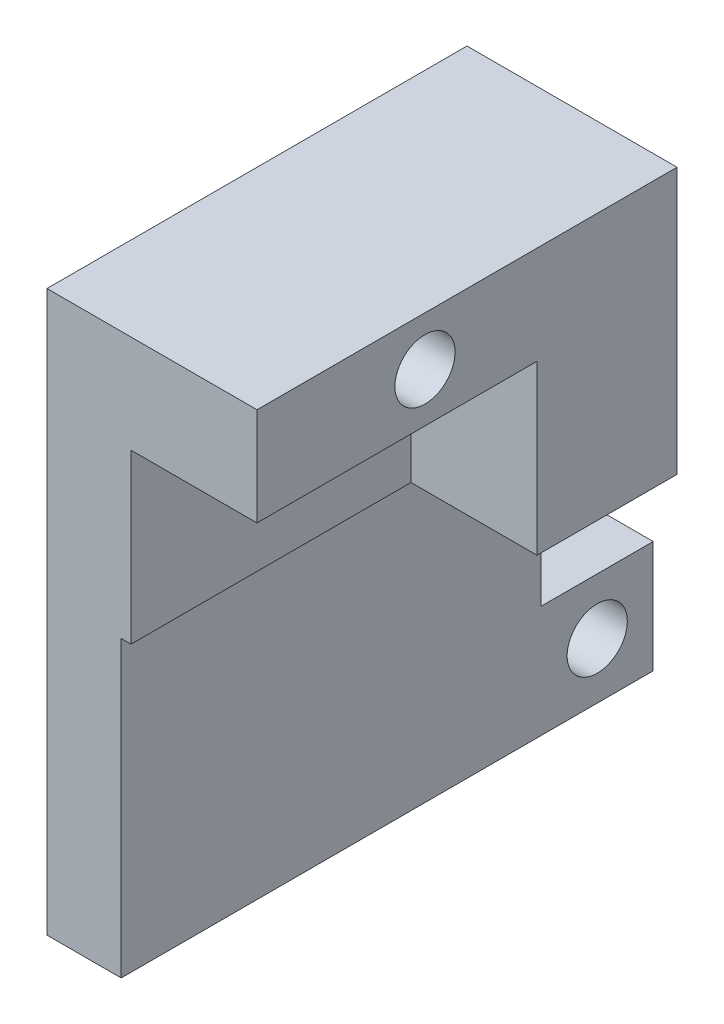
ISO-10303-21;
HEADER;
FILE_DESCRIPTION(('STEP AP214'),'2;1');
FILE_NAME('part.step','',(''),(''),'','','');
FILE_SCHEMA(('AUTOMOTIVE_DESIGN { 1 0 10303 214 1 1 1 1 }'));
ENDSEC;
DATA;
#1=APPLICATION_CONTEXT('core data for automotive mechanical design processes');
#2=APPLICATION_PROTOCOL_DEFINITION('international standard','automotive_design',2000,#1);
#3=PRODUCT_CONTEXT('',#1,'mechanical');
#4=PRODUCT('Part','Part','',(#3));
#5=PRODUCT_RELATED_PRODUCT_CATEGORY('part','',(#4));
#6=PRODUCT_DEFINITION_FORMATION('','',#4);
#7=PRODUCT_DEFINITION_CONTEXT('part definition',#1,'design');
#8=PRODUCT_DEFINITION('design','',#6,#7);
#9=PRODUCT_DEFINITION_SHAPE('','',#8);
#10=(LENGTH_UNIT() NAMED_UNIT(*) SI_UNIT(.MILLI.,.METRE.));
#11=(NAMED_UNIT(*) PLANE_ANGLE_UNIT() SI_UNIT($,.RADIAN.));
#12=(NAMED_UNIT(*) SI_UNIT($,.STERADIAN.) SOLID_ANGLE_UNIT());
#13=UNCERTAINTY_MEASURE_WITH_UNIT(LENGTH_MEASURE(1.E-05),#10,'distance_accuracy_value','');
#14=(GEOMETRIC_REPRESENTATION_CONTEXT(3) GLOBAL_UNCERTAINTY_ASSIGNED_CONTEXT((#13)) GLOBAL_UNIT_ASSIGNED_CONTEXT((#10,
#11,#12)) REPRESENTATION_CONTEXT('',''));
#15=CARTESIAN_POINT('',(0.,0.,0.));
#16=DIRECTION('',(0.,0.,1.));
#17=DIRECTION('',(1.,0.,0.));
#18=AXIS2_PLACEMENT_3D('',#15,#16,#17);
#19=CARTESIAN_POINT('',(0.,-20.,0.));
#20=DIRECTION('',(0.,1.,0.));
#21=DIRECTION('',(0.,0.,1.));
#22=AXIS2_PLACEMENT_3D('',#19,#20,#21);
#23=PLANE('',#22);
#24=DIRECTION('',(-1.,0.,0.));
#25=VECTOR('',#24,1.);
#26=CARTESIAN_POINT('',(-6.58064516129031,-20.,-39.4516129032258));
#27=LINE('',#26,#25);
#28=CARTESIAN_POINT('',(-7.28064516129031,-20.,-39.4516129032258));
#29=VERTEX_POINT('',#28);
#30=CARTESIAN_POINT('',(-12.5806451612903,-20.,-39.4516129032258));
#31=VERTEX_POINT('',#30);
#32=EDGE_CURVE('E143',#29,#31,#27,.T.);
#33=ORIENTED_EDGE('',*,*,#32,.F.);
#34=DIRECTION('',(0.,0.,-1.));
#35=VECTOR('',#34,1.);
#36=CARTESIAN_POINT('',(-7.28064516129031,-20.,-31.4516129032258));
#37=LINE('',#36,#35);
#38=CARTESIAN_POINT('',(-7.28064516129031,-20.,-1.45161290322578));
#39=VERTEX_POINT('',#38);
#40=EDGE_CURVE('E126',#39,#29,#37,.T.);
#41=ORIENTED_EDGE('',*,*,#40,.F.);
#42=DIRECTION('',(-1.,0.,0.));
#43=VECTOR('',#42,1.);
#44=CARTESIAN_POINT('',(2.42035483870969,-20.,-1.45161290322578));
#45=LINE('',#44,#43);
#46=CARTESIAN_POINT('',(-12.5806451612903,-20.,-1.45161290322578));
#47=VERTEX_POINT('',#46);
#48=EDGE_CURVE('E236',#39,#47,#45,.T.);
#49=ORIENTED_EDGE('',*,*,#48,.T.);
#50=DIRECTION('',(0.,0.,1.));
#51=VECTOR('',#50,1.);
#52=CARTESIAN_POINT('',(-12.5806451612903,-20.,-31.4516129032258));
#53=LINE('',#52,#51);
#54=EDGE_CURVE('E151',#31,#47,#53,.T.);
#55=ORIENTED_EDGE('',*,*,#54,.F.);
#56=EDGE_LOOP('',(#33,#41,#49,#55));
#57=FACE_BOUND('',#56,.T.);
#58=ADVANCED_FACE('F43',(#57),#23,.F.);
#59=CARTESIAN_POINT('',(-6.58064516129031,-12.,-39.4516129032258));
#60=DIRECTION('',(0.,-1.,0.));
#61=DIRECTION('',(0.,0.,-1.));
#62=AXIS2_PLACEMENT_3D('',#59,#60,#61);
#63=PLANE('',#62);
#64=DIRECTION('',(0.,0.,1.));
#65=VECTOR('',#64,1.);
#66=CARTESIAN_POINT('',(-7.28064516129031,-12.,-31.4516129032258));
#67=LINE('',#66,#65);
#68=CARTESIAN_POINT('',(-7.28064516129031,-12.,-39.4516129032258));
#69=VERTEX_POINT('',#68);
#70=CARTESIAN_POINT('',(-7.28064516129031,-12.,-31.4516129032258));
#71=VERTEX_POINT('',#70);
#72=EDGE_CURVE('E148',#69,#71,#67,.T.);
#73=ORIENTED_EDGE('',*,*,#72,.F.);
#74=DIRECTION('',(1.,0.,0.));
#75=VECTOR('',#74,1.);
#76=CARTESIAN_POINT('',(-6.58064516129031,-12.,-39.4516129032258));
#77=LINE('',#76,#75);
#78=CARTESIAN_POINT('',(-12.5806451612903,-12.,-39.4516129032258));
#79=VERTEX_POINT('',#78);
#80=EDGE_CURVE('E146',#79,#69,#77,.T.);
#81=ORIENTED_EDGE('',*,*,#80,.F.);
#82=DIRECTION('',(0.,0.,1.));
#83=VECTOR('',#82,1.);
#84=CARTESIAN_POINT('',(-12.5806451612903,-12.,-39.4516129032258));
#85=LINE('',#84,#83);
#86=CARTESIAN_POINT('',(-12.5806451612903,-12.,-31.4516129032258));
#87=VERTEX_POINT('',#86);
#88=EDGE_CURVE('E167',#79,#87,#85,.T.);
#89=ORIENTED_EDGE('',*,*,#88,.T.);
#90=DIRECTION('',(1.,0.,0.));
#91=VECTOR('',#90,1.);
#92=CARTESIAN_POINT('',(-6.58064516129031,-12.,-31.4516129032258));
#93=LINE('',#92,#91);
#94=EDGE_CURVE('E155',#87,#71,#93,.T.);
#95=ORIENTED_EDGE('',*,*,#94,.T.);
#96=EDGE_LOOP('',(#73,#81,#89,#95));
#97=FACE_BOUND('',#96,.T.);
#98=ADVANCED_FACE('F208',(#97),#63,.F.);
#99=CARTESIAN_POINT('',(0.,0.,-39.4516129032258));
#100=DIRECTION('',(0.,0.,-1.));
#101=DIRECTION('',(-1.,0.,0.));
#102=AXIS2_PLACEMENT_3D('',#99,#100,#101);
#103=PLANE('',#102);
#104=ORIENTED_EDGE('',*,*,#80,.T.);
#105=DIRECTION('',(0.,1.,0.));
#106=VECTOR('',#105,1.);
#107=CARTESIAN_POINT('',(-7.28064516129031,-12.,-39.4516129032258));
#108=LINE('',#107,#106);
#109=EDGE_CURVE('E130',#29,#69,#108,.T.);
#110=ORIENTED_EDGE('',*,*,#109,.F.);
#111=ORIENTED_EDGE('',*,*,#32,.T.);
#112=DIRECTION('',(0.,1.,0.));
#113=VECTOR('',#112,1.);
#114=CARTESIAN_POINT('',(-12.5806451612903,-12.,-39.4516129032258));
#115=LINE('',#114,#113);
#116=EDGE_CURVE('E154',#31,#79,#115,.T.);
#117=ORIENTED_EDGE('',*,*,#116,.T.);
#118=EDGE_LOOP('',(#104,#110,#111,#117));
#119=FACE_BOUND('',#118,.T.);
#120=ADVANCED_FACE('F142',(#119),#103,.T.);
#121=CARTESIAN_POINT('',(2.41935483870969,-16.,-35.4516129032258));
#122=DIRECTION('',(-1.,0.,0.));
#123=DIRECTION('',(0.,0.,1.));
#124=AXIS2_PLACEMENT_3D('',#121,#122,#123);
#125=CYLINDRICAL_SURFACE('',#124,2.15);
#126=CARTESIAN_POINT('',(-12.5806451612903,-16.,-35.4516129032258));
#127=DIRECTION('',(-1.,0.,0.));
#128=DIRECTION('',(0.,0.,1.));
#129=AXIS2_PLACEMENT_3D('',#126,#127,#128);
#130=CIRCLE('',#129,2.15);
#131=CARTESIAN_POINT('',(-12.5806451612903,-16.,-33.3016129032258));
#132=VERTEX_POINT('',#131);
#133=EDGE_CURVE('E161',#132,#132,#130,.T.);
#134=ORIENTED_EDGE('',*,*,#133,.T.);
#135=EDGE_LOOP('',(#134));
#136=FACE_BOUND('',#135,.T.);
#137=CARTESIAN_POINT('',(-7.28064516129031,-16.,-35.4516129032258));
#138=DIRECTION('',(1.,0.,0.));
#139=DIRECTION('',(0.,0.,-1.));
#140=AXIS2_PLACEMENT_3D('',#137,#138,#139);
#141=CIRCLE('',#140,2.15);
#142=CARTESIAN_POINT('',(-7.28064516129031,-16.,-37.6016129032258));
#143=VERTEX_POINT('',#142);
#144=EDGE_CURVE('E211',#143,#143,#141,.F.);
#145=ORIENTED_EDGE('',*,*,#144,.F.);
#146=EDGE_LOOP('',(#145));
#147=FACE_BOUND('',#146,.T.);
#148=ADVANCED_FACE('F275',(#136,#147),#125,.F.);
#149=CARTESIAN_POINT('',(-6.58064516129031,20.,-31.4516129032258));
#150=DIRECTION('',(-1.,0.,0.));
#151=DIRECTION('',(0.,0.,1.));
#152=AXIS2_PLACEMENT_3D('',#149,#150,#151);
#153=PLANE('',#152);
#154=DIRECTION('',(0.,1.,0.));
#155=VECTOR('',#154,1.);
#156=CARTESIAN_POINT('',(-6.58064516129031,20.,-1.45161290322579));
#157=LINE('',#156,#155);
#158=CARTESIAN_POINT('',(-6.58064516129031,0.999999999999997,-1.45161290322578));
#159=VERTEX_POINT('',#158);
#160=CARTESIAN_POINT('',(-6.58064516129031,13.,-1.45161290322579));
#161=VERTEX_POINT('',#160);
#162=EDGE_CURVE('E243',#159,#161,#157,.T.);
#163=ORIENTED_EDGE('',*,*,#162,.F.);
#164=DIRECTION('',(0.,0.,1.));
#165=VECTOR('',#164,1.);
#166=CARTESIAN_POINT('',(-6.58064516129031,1.,-31.4516129032258));
#167=LINE('',#166,#165);
#168=CARTESIAN_POINT('',(-6.58064516129031,1.,-21.4516129032258));
#169=VERTEX_POINT('',#168);
#170=EDGE_CURVE('E215',#169,#159,#167,.T.);
#171=ORIENTED_EDGE('',*,*,#170,.F.);
#172=DIRECTION('',(0.,1.,0.));
#173=VECTOR('',#172,1.);
#174=CARTESIAN_POINT('',(-6.58064516129031,1.,-21.4516129032258));
#175=LINE('',#174,#173);
#176=CARTESIAN_POINT('',(-6.58064516129031,13.,-21.4516129032258));
#177=VERTEX_POINT('',#176);
#178=EDGE_CURVE('E259',#169,#177,#175,.T.);
#179=ORIENTED_EDGE('',*,*,#178,.T.);
#180=DIRECTION('',(0.,0.,-1.));
#181=VECTOR('',#180,1.);
#182=CARTESIAN_POINT('',(-6.58064516129031,13.,3.54838709677421));
#183=LINE('',#182,#181);
#184=EDGE_CURVE('E177',#161,#177,#183,.T.);
#185=ORIENTED_EDGE('',*,*,#184,.F.);
#186=EDGE_LOOP('',(#163,#171,#179,#185));
#187=FACE_BOUND('',#186,.T.);
#188=ADVANCED_FACE('F311',(#187),#153,.F.);
#189=CARTESIAN_POINT('',(2.41935483870969,13.,3.5483870967742));
#190=DIRECTION('',(0.,1.,0.));
#191=DIRECTION('',(0.,0.,1.));
#192=AXIS2_PLACEMENT_3D('',#189,#190,#191);
#193=PLANE('',#192);
#194=DIRECTION('',(0.,0.,-1.));
#195=VECTOR('',#194,1.);
#196=CARTESIAN_POINT('',(2.41935483870969,13.,3.5483870967742));
#197=LINE('',#196,#195);
#198=CARTESIAN_POINT('',(2.41935483870969,13.,-1.45161290322579));
#199=VERTEX_POINT('',#198);
#200=CARTESIAN_POINT('',(2.41935483870969,13.,-21.4516129032258));
#201=VERTEX_POINT('',#200);
#202=EDGE_CURVE('E181',#199,#201,#197,.T.);
#203=ORIENTED_EDGE('',*,*,#202,.F.);
#204=DIRECTION('',(1.,0.,0.));
#205=VECTOR('',#204,1.);
#206=CARTESIAN_POINT('',(2.42035483870969,13.,-1.45161290322579));
#207=LINE('',#206,#205);
#208=EDGE_CURVE('E67',#161,#199,#207,.T.);
#209=ORIENTED_EDGE('',*,*,#208,.F.);
#210=ORIENTED_EDGE('',*,*,#184,.T.);
#211=DIRECTION('',(-1.,0.,0.));
#212=VECTOR('',#211,1.);
#213=CARTESIAN_POINT('',(2.41935483870969,13.,-21.4516129032258));
#214=LINE('',#213,#212);
#215=EDGE_CURVE('E246',#201,#177,#214,.T.);
#216=ORIENTED_EDGE('',*,*,#215,.F.);
#217=EDGE_LOOP('',(#203,#209,#210,#216));
#218=FACE_BOUND('',#217,.T.);
#219=ADVANCED_FACE('F309',(#218),#193,.F.);
#220=CARTESIAN_POINT('',(-12.5806451612903,20.,-31.4516129032258));
#221=DIRECTION('',(0.,0.,1.));
#222=DIRECTION('',(1.,0.,0.));
#223=AXIS2_PLACEMENT_3D('',#220,#221,#222);
#224=PLANE('',#223);
#225=DIRECTION('',(1.,0.,0.));
#226=VECTOR('',#225,1.);
#227=CARTESIAN_POINT('',(2.41935483870969,1.,-31.4516129032258));
#228=LINE('',#227,#226);
#229=CARTESIAN_POINT('',(-7.28064516129031,1.,-31.4516129032258));
#230=VERTEX_POINT('',#229);
#231=CARTESIAN_POINT('',(2.41935483870969,1.,-31.4516129032258));
#232=VERTEX_POINT('',#231);
#233=EDGE_CURVE('E255',#230,#232,#228,.T.);
#234=ORIENTED_EDGE('',*,*,#233,.F.);
#235=DIRECTION('',(0.,1.,0.));
#236=VECTOR('',#235,1.);
#237=CARTESIAN_POINT('',(-7.28064516129031,1.,-31.4516129032258));
#238=LINE('',#237,#236);
#239=EDGE_CURVE('E218',#71,#230,#238,.T.);
#240=ORIENTED_EDGE('',*,*,#239,.F.);
#241=ORIENTED_EDGE('',*,*,#94,.F.);
#242=DIRECTION('',(0.,-1.,0.));
#243=VECTOR('',#242,1.);
#244=CARTESIAN_POINT('',(-12.5806451612903,20.,-31.4516129032258));
#245=LINE('',#244,#243);
#246=CARTESIAN_POINT('',(-12.5806451612903,20.,-31.4516129032258));
#247=VERTEX_POINT('',#246);
#248=EDGE_CURVE('E11',#247,#87,#245,.T.);
#249=ORIENTED_EDGE('',*,*,#248,.F.);
#250=DIRECTION('',(-1.,0.,0.));
#251=VECTOR('',#250,1.);
#252=CARTESIAN_POINT('',(-12.5806451612903,20.,-31.4516129032258));
#253=LINE('',#252,#251);
#254=CARTESIAN_POINT('',(2.41935483870969,20.,-31.4516129032258));
#255=VERTEX_POINT('',#254);
#256=EDGE_CURVE('E52',#255,#247,#253,.T.);
#257=ORIENTED_EDGE('',*,*,#256,.F.);
#258=DIRECTION('',(0.,1.,0.));
#259=VECTOR('',#258,1.);
#260=CARTESIAN_POINT('',(2.41935483870969,20.,-31.4516129032258));
#261=LINE('',#260,#259);
#262=EDGE_CURVE('E184',#232,#255,#261,.T.);
#263=ORIENTED_EDGE('',*,*,#262,.F.);
#264=EDGE_LOOP('',(#234,#240,#241,#249,#257,#263));
#265=FACE_BOUND('',#264,.T.);
#266=ADVANCED_FACE('F281',(#265),#224,.F.);
#267=CARTESIAN_POINT('',(-12.5806451612903,20.,-31.4516129032258));
#268=DIRECTION('',(1.,0.,0.));
#269=DIRECTION('',(0.,0.,-1.));
#270=AXIS2_PLACEMENT_3D('',#267,#268,#269);
#271=PLANE('',#270);
#272=ORIENTED_EDGE('',*,*,#133,.F.);
#273=EDGE_LOOP('',(#272));
#274=FACE_BOUND('',#273,.T.);
#275=CARTESIAN_POINT('',(-12.5806451612903,16.5,-13.4516129032258));
#276=DIRECTION('',(1.,0.,0.));
#277=DIRECTION('',(0.,0.,-1.));
#278=AXIS2_PLACEMENT_3D('',#275,#276,#277);
#279=CIRCLE('',#278,2.15);
#280=CARTESIAN_POINT('',(-12.5806451612903,16.5,-15.6016129032258));
#281=VERTEX_POINT('',#280);
#282=EDGE_CURVE('E173',#281,#281,#279,.T.);
#283=ORIENTED_EDGE('',*,*,#282,.T.);
#284=EDGE_LOOP('',(#283));
#285=FACE_BOUND('',#284,.T.);
#286=ORIENTED_EDGE('',*,*,#54,.T.);
#287=DIRECTION('',(0.,-1.,0.));
#288=VECTOR('',#287,1.);
#289=CARTESIAN_POINT('',(-12.5806451612903,20.,-1.45161290322579));
#290=LINE('',#289,#288);
#291=CARTESIAN_POINT('',(-12.5806451612903,20.,-1.45161290322579));
#292=VERTEX_POINT('',#291);
#293=EDGE_CURVE('E204',#292,#47,#290,.T.);
#294=ORIENTED_EDGE('',*,*,#293,.F.);
#295=DIRECTION('',(0.,0.,1.));
#296=VECTOR('',#295,1.);
#297=CARTESIAN_POINT('',(-12.5806451612903,20.,-31.4516129032258));
#298=LINE('',#297,#296);
#299=EDGE_CURVE('E194',#247,#292,#298,.T.);
#300=ORIENTED_EDGE('',*,*,#299,.F.);
#301=ORIENTED_EDGE('',*,*,#248,.T.);
#302=ORIENTED_EDGE('',*,*,#88,.F.);
#303=ORIENTED_EDGE('',*,*,#116,.F.);
#304=EDGE_LOOP('',(#286,#294,#300,#301,#302,#303));
#305=FACE_BOUND('',#304,.T.);
#306=ADVANCED_FACE('F45',(#274,#285,#305),#271,.F.);
#307=CARTESIAN_POINT('',(0.,20.,0.));
#308=DIRECTION('',(0.,1.,0.));
#309=DIRECTION('',(0.,0.,1.));
#310=AXIS2_PLACEMENT_3D('',#307,#308,#309);
#311=PLANE('',#310);
#312=DIRECTION('',(-1.,0.,0.));
#313=VECTOR('',#312,1.);
#314=CARTESIAN_POINT('',(2.42035483870969,20.,-1.45161290322579));
#315=LINE('',#314,#313);
#316=CARTESIAN_POINT('',(2.41935483870969,20.,-1.45161290322579));
#317=VERTEX_POINT('',#316);
#318=EDGE_CURVE('E235',#317,#292,#315,.T.);
#319=ORIENTED_EDGE('',*,*,#318,.F.);
#320=DIRECTION('',(0.,0.,1.));
#321=VECTOR('',#320,1.);
#322=CARTESIAN_POINT('',(2.41935483870969,20.,3.54838709677421));
#323=LINE('',#322,#321);
#324=EDGE_CURVE('E188',#255,#317,#323,.T.);
#325=ORIENTED_EDGE('',*,*,#324,.F.);
#326=ORIENTED_EDGE('',*,*,#256,.T.);
#327=ORIENTED_EDGE('',*,*,#299,.T.);
#328=EDGE_LOOP('',(#319,#325,#326,#327));
#329=FACE_BOUND('',#328,.T.);
#330=ADVANCED_FACE('F280',(#329),#311,.T.);
#331=CARTESIAN_POINT('',(2.41935483870969,0.,0.));
#332=DIRECTION('',(1.,0.,0.));
#333=DIRECTION('',(0.,0.,-1.));
#334=AXIS2_PLACEMENT_3D('',#331,#332,#333);
#335=PLANE('',#334);
#336=DIRECTION('',(0.,-1.,0.));
#337=VECTOR('',#336,1.);
#338=CARTESIAN_POINT('',(2.41935483870969,20.,-1.45161290322579));
#339=LINE('',#338,#337);
#340=EDGE_CURVE('E230',#317,#199,#339,.T.);
#341=ORIENTED_EDGE('',*,*,#340,.T.);
#342=ORIENTED_EDGE('',*,*,#202,.T.);
#343=DIRECTION('',(0.,1.,0.));
#344=VECTOR('',#343,1.);
#345=CARTESIAN_POINT('',(2.41935483870969,1.,-21.4516129032258));
#346=LINE('',#345,#344);
#347=CARTESIAN_POINT('',(2.41935483870969,1.,-21.4516129032258));
#348=VERTEX_POINT('',#347);
#349=EDGE_CURVE('E265',#348,#201,#346,.T.);
#350=ORIENTED_EDGE('',*,*,#349,.F.);
#351=DIRECTION('',(0.,0.,1.));
#352=VECTOR('',#351,1.);
#353=CARTESIAN_POINT('',(2.41935483870969,1.,-31.4516129032258));
#354=LINE('',#353,#352);
#355=EDGE_CURVE('E247',#232,#348,#354,.T.);
#356=ORIENTED_EDGE('',*,*,#355,.F.);
#357=ORIENTED_EDGE('',*,*,#262,.T.);
#358=ORIENTED_EDGE('',*,*,#324,.T.);
#359=EDGE_LOOP('',(#341,#342,#350,#356,#357,#358));
#360=FACE_BOUND('',#359,.T.);
#361=CARTESIAN_POINT('',(2.41935483870969,16.5,-13.4516129032258));
#362=DIRECTION('',(1.,0.,0.));
#363=DIRECTION('',(0.,0.,-1.));
#364=AXIS2_PLACEMENT_3D('',#361,#362,#363);
#365=CIRCLE('',#364,2.15);
#366=CARTESIAN_POINT('',(2.41935483870969,16.5,-15.6016129032258));
#367=VERTEX_POINT('',#366);
#368=EDGE_CURVE('E172',#367,#367,#365,.T.);
#369=ORIENTED_EDGE('',*,*,#368,.F.);
#370=EDGE_LOOP('',(#369));
#371=FACE_BOUND('',#370,.T.);
#372=ADVANCED_FACE('F288',(#360,#371),#335,.T.);
#373=CARTESIAN_POINT('',(-12.5806451612903,16.5,-13.4516129032258));
#374=DIRECTION('',(1.,0.,0.));
#375=DIRECTION('',(0.,0.,-1.));
#376=AXIS2_PLACEMENT_3D('',#373,#374,#375);
#377=CYLINDRICAL_SURFACE('',#376,2.15);
#378=ORIENTED_EDGE('',*,*,#282,.F.);
#379=EDGE_LOOP('',(#378));
#380=FACE_BOUND('',#379,.T.);
#381=ORIENTED_EDGE('',*,*,#368,.T.);
#382=EDGE_LOOP('',(#381));
#383=FACE_BOUND('',#382,.T.);
#384=ADVANCED_FACE('F284',(#380,#383),#377,.F.);
#385=CARTESIAN_POINT('',(2.41935483870969,1.,-21.4516129032258));
#386=DIRECTION('',(0.,0.,-1.));
#387=DIRECTION('',(-1.,0.,0.));
#388=AXIS2_PLACEMENT_3D('',#385,#386,#387);
#389=PLANE('',#388);
#390=ORIENTED_EDGE('',*,*,#215,.T.);
#391=ORIENTED_EDGE('',*,*,#178,.F.);
#392=DIRECTION('',(-1.,0.,0.));
#393=VECTOR('',#392,1.);
#394=CARTESIAN_POINT('',(2.41935483870969,1.,-21.4516129032258));
#395=LINE('',#394,#393);
#396=EDGE_CURVE('E251',#348,#169,#395,.T.);
#397=ORIENTED_EDGE('',*,*,#396,.F.);
#398=ORIENTED_EDGE('',*,*,#349,.T.);
#399=EDGE_LOOP('',(#390,#391,#397,#398));
#400=FACE_BOUND('',#399,.T.);
#401=ADVANCED_FACE('F287',(#400),#389,.F.);
#402=CARTESIAN_POINT('',(0.,1.,0.));
#403=DIRECTION('',(0.,-1.,0.));
#404=DIRECTION('',(0.,0.,-1.));
#405=AXIS2_PLACEMENT_3D('',#402,#403,#404);
#406=PLANE('',#405);
#407=ORIENTED_EDGE('',*,*,#355,.T.);
#408=ORIENTED_EDGE('',*,*,#396,.T.);
#409=ORIENTED_EDGE('',*,*,#170,.T.);
#410=DIRECTION('',(1.,0.,0.));
#411=VECTOR('',#410,1.);
#412=CARTESIAN_POINT('',(-7.28064516129031,0.999999999999997,-1.45161290322578));
#413=LINE('',#412,#411);
#414=CARTESIAN_POINT('',(-7.28064516129031,1.,-1.45161290322579));
#415=VERTEX_POINT('',#414);
#416=EDGE_CURVE('E138',#415,#159,#413,.T.);
#417=ORIENTED_EDGE('',*,*,#416,.F.);
#418=DIRECTION('',(0.,0.,1.));
#419=VECTOR('',#418,1.);
#420=CARTESIAN_POINT('',(-7.28064516129031,1.,-31.4516129032258));
#421=LINE('',#420,#419);
#422=EDGE_CURVE('E59',#230,#415,#421,.T.);
#423=ORIENTED_EDGE('',*,*,#422,.F.);
#424=ORIENTED_EDGE('',*,*,#233,.T.);
#425=EDGE_LOOP('',(#407,#408,#409,#417,#423,#424));
#426=FACE_BOUND('',#425,.T.);
#427=ADVANCED_FACE('F328',(#426),#406,.T.);
#428=CARTESIAN_POINT('',(2.42035483870969,20.,-1.45161290322579));
#429=DIRECTION('',(0.,0.,-1.));
#430=DIRECTION('',(0.,1.,0.));
#431=AXIS2_PLACEMENT_3D('',#428,#429,#430);
#432=PLANE('',#431);
#433=DIRECTION('',(0.,-1.,0.));
#434=VECTOR('',#433,1.);
#435=CARTESIAN_POINT('',(-7.28064516129031,0.999999999999997,-1.45161290322578));
#436=LINE('',#435,#434);
#437=EDGE_CURVE('E133',#415,#39,#436,.T.);
#438=ORIENTED_EDGE('',*,*,#437,.F.);
#439=ORIENTED_EDGE('',*,*,#416,.T.);
#440=ORIENTED_EDGE('',*,*,#162,.T.);
#441=ORIENTED_EDGE('',*,*,#208,.T.);
#442=ORIENTED_EDGE('',*,*,#340,.F.);
#443=ORIENTED_EDGE('',*,*,#318,.T.);
#444=ORIENTED_EDGE('',*,*,#293,.T.);
#445=ORIENTED_EDGE('',*,*,#48,.F.);
#446=EDGE_LOOP('',(#438,#439,#440,#441,#442,#443,#444,#445));
#447=FACE_BOUND('',#446,.T.);
#448=ADVANCED_FACE('F322',(#447),#432,.F.);
#449=CARTESIAN_POINT('',(-7.28064516129031,0.,0.));
#450=DIRECTION('',(-1.,0.,0.));
#451=DIRECTION('',(0.,0.,1.));
#452=AXIS2_PLACEMENT_3D('',#449,#450,#451);
#453=PLANE('',#452);
#454=ORIENTED_EDGE('',*,*,#40,.T.);
#455=ORIENTED_EDGE('',*,*,#109,.T.);
#456=ORIENTED_EDGE('',*,*,#72,.T.);
#457=ORIENTED_EDGE('',*,*,#239,.T.);
#458=ORIENTED_EDGE('',*,*,#422,.T.);
#459=ORIENTED_EDGE('',*,*,#437,.T.);
#460=EDGE_LOOP('',(#454,#455,#456,#457,#458,#459));
#461=FACE_BOUND('',#460,.T.);
#462=ORIENTED_EDGE('',*,*,#144,.T.);
#463=EDGE_LOOP('',(#462));
#464=FACE_BOUND('',#463,.T.);
#465=ADVANCED_FACE('F128',(#461,#464),#453,.F.);
#466=CLOSED_SHELL('',(#58,#98,#120,#148,#188,#219,#266,#306,#330,#372,#384,#401,#427,#448,#465));
#467=MANIFOLD_SOLID_BREP('B2',#466);
#468=ADVANCED_BREP_SHAPE_REPRESENTATION('',(#18,#467),#14);
#469=SHAPE_DEFINITION_REPRESENTATION(#9,#468);
ENDSEC;
END-ISO-10303-21;
